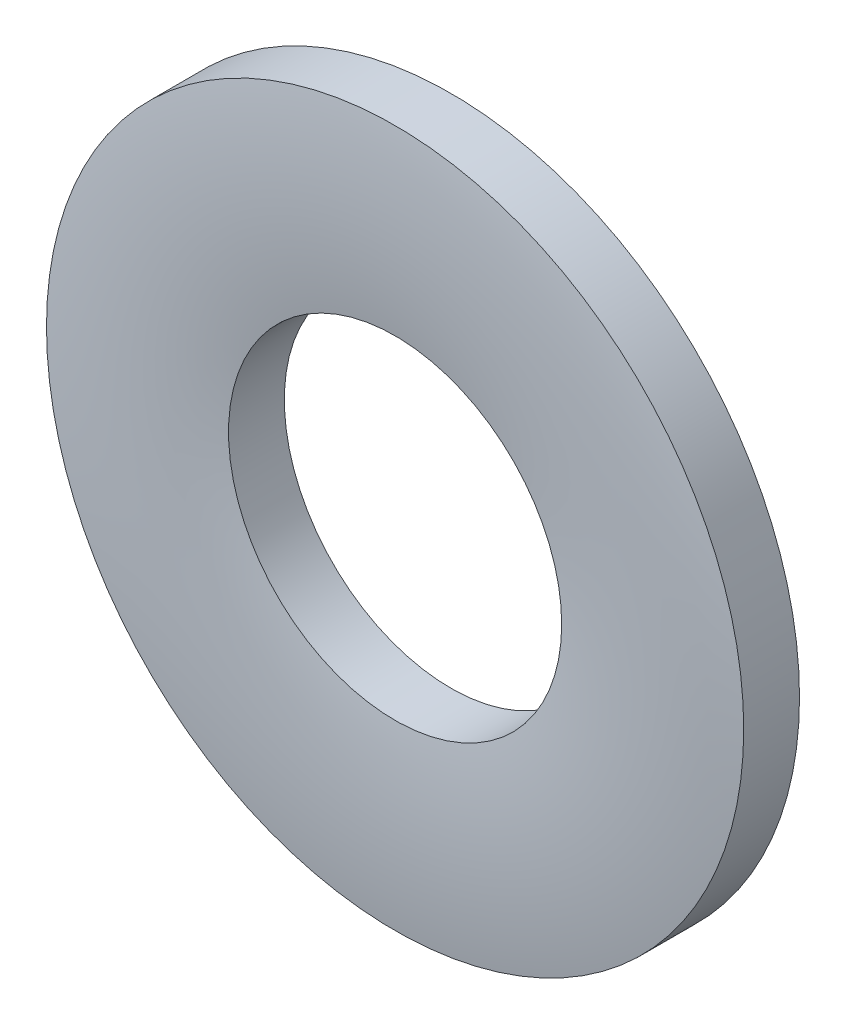
ISO-10303-21;
HEADER;
FILE_DESCRIPTION(('STEP AP214'),'2;1');
FILE_NAME('part.step','',(''),(''),'','','');
FILE_SCHEMA(('AUTOMOTIVE_DESIGN { 1 0 10303 214 1 1 1 1 }'));
ENDSEC;
DATA;
#1=APPLICATION_CONTEXT('core data for automotive mechanical design processes');
#2=APPLICATION_PROTOCOL_DEFINITION('international standard','automotive_design',2000,#1);
#3=PRODUCT_CONTEXT('',#1,'mechanical');
#4=PRODUCT('Part','Part','',(#3));
#5=PRODUCT_RELATED_PRODUCT_CATEGORY('part','',(#4));
#6=PRODUCT_DEFINITION_FORMATION('','',#4);
#7=PRODUCT_DEFINITION_CONTEXT('part definition',#1,'design');
#8=PRODUCT_DEFINITION('design','',#6,#7);
#9=PRODUCT_DEFINITION_SHAPE('','',#8);
#10=(LENGTH_UNIT() NAMED_UNIT(*) SI_UNIT(.MILLI.,.METRE.));
#11=(NAMED_UNIT(*) PLANE_ANGLE_UNIT() SI_UNIT($,.RADIAN.));
#12=(NAMED_UNIT(*) SI_UNIT($,.STERADIAN.) SOLID_ANGLE_UNIT());
#13=UNCERTAINTY_MEASURE_WITH_UNIT(LENGTH_MEASURE(1.E-05),#10,'distance_accuracy_value','');
#14=(GEOMETRIC_REPRESENTATION_CONTEXT(3) GLOBAL_UNCERTAINTY_ASSIGNED_CONTEXT((#13)) GLOBAL_UNIT_ASSIGNED_CONTEXT((#10,
#11,#12)) REPRESENTATION_CONTEXT('',''));
#15=CARTESIAN_POINT('',(0.,0.,0.));
#16=DIRECTION('',(0.,0.,1.));
#17=DIRECTION('',(1.,0.,0.));
#18=AXIS2_PLACEMENT_3D('',#15,#16,#17);
#19=CARTESIAN_POINT('',(0.,2.15,-0.400000000000003));
#20=DIRECTION('',(0.,0.,1.));
#21=DIRECTION('',(1.,0.,0.));
#22=AXIS2_PLACEMENT_3D('',#19,#20,#21);
#23=PLANE('',#22);
#24=CARTESIAN_POINT('',(0.,0.,-0.400000000000003));
#25=DIRECTION('',(0.,0.,1.));
#26=DIRECTION('',(1.,0.,0.));
#27=AXIS2_PLACEMENT_3D('',#24,#25,#26);
#28=CIRCLE('',#27,4.5);
#29=CARTESIAN_POINT('',(4.5,0.,-0.400000000000003));
#30=VERTEX_POINT('',#29);
#31=EDGE_CURVE('E51',#30,#30,#28,.T.);
#32=ORIENTED_EDGE('',*,*,#31,.F.);
#33=EDGE_LOOP('',(#32));
#34=FACE_BOUND('',#33,.T.);
#35=CARTESIAN_POINT('',(0.,0.,-0.400000000000003));
#36=DIRECTION('',(0.,0.,1.));
#37=DIRECTION('',(1.,0.,0.));
#38=AXIS2_PLACEMENT_3D('',#35,#36,#37);
#39=CIRCLE('',#38,2.15);
#40=CARTESIAN_POINT('',(2.15,0.,-0.400000000000003));
#41=VERTEX_POINT('',#40);
#42=EDGE_CURVE('E10',#41,#41,#39,.T.);
#43=ORIENTED_EDGE('',*,*,#42,.T.);
#44=EDGE_LOOP('',(#43));
#45=FACE_BOUND('',#44,.T.);
#46=ADVANCED_FACE('F37',(#34,#45),#23,.F.);
#47=CARTESIAN_POINT('',(0.,0.,0.4));
#48=DIRECTION('',(0.,0.,1.));
#49=DIRECTION('',(1.,0.,0.));
#50=AXIS2_PLACEMENT_3D('',#47,#48,#49);
#51=CYLINDRICAL_SURFACE('',#50,2.15);
#52=ORIENTED_EDGE('',*,*,#42,.F.);
#53=EDGE_LOOP('',(#52));
#54=FACE_BOUND('',#53,.T.);
#55=CARTESIAN_POINT('',(0.,0.,0.319999999999997));
#56=DIRECTION('',(0.,0.,1.));
#57=DIRECTION('',(1.,0.,0.));
#58=AXIS2_PLACEMENT_3D('',#55,#56,#57);
#59=CIRCLE('',#58,2.15);
#60=CARTESIAN_POINT('',(2.15,0.,0.319999999999997));
#61=VERTEX_POINT('',#60);
#62=EDGE_CURVE('E43',#61,#61,#59,.T.);
#63=ORIENTED_EDGE('',*,*,#62,.T.);
#64=EDGE_LOOP('',(#63));
#65=FACE_BOUND('',#64,.T.);
#66=ADVANCED_FACE('F60',(#54,#65),#51,.F.);
#67=CARTESIAN_POINT('',(0.,0.,-8.26890625000004));
#68=DIRECTION('',(0.,0.,1.));
#69=DIRECTION('',(1.,0.,0.));
#70=AXIS2_PLACEMENT_3D('',#67,#68,#69);
#71=DEGENERATE_TOROIDAL_SURFACE('',#70,3.325,8.66890625000004,.T.);
#72=ORIENTED_EDGE('',*,*,#62,.F.);
#73=EDGE_LOOP('',(#72));
#74=FACE_BOUND('',#73,.T.);
#75=CARTESIAN_POINT('',(0.,0.,0.319999999999997));
#76=DIRECTION('',(0.,0.,1.));
#77=DIRECTION('',(1.,0.,0.));
#78=AXIS2_PLACEMENT_3D('',#75,#76,#77);
#79=CIRCLE('',#78,4.5);
#80=CARTESIAN_POINT('',(4.5,0.,0.319999999999997));
#81=VERTEX_POINT('',#80);
#82=EDGE_CURVE('E47',#81,#81,#79,.T.);
#83=ORIENTED_EDGE('',*,*,#82,.T.);
#84=EDGE_LOOP('',(#83));
#85=FACE_BOUND('',#84,.T.);
#86=ADVANCED_FACE('F64',(#74,#85),#71,.T.);
#87=CARTESIAN_POINT('',(0.,0.,0.4));
#88=DIRECTION('',(0.,0.,1.));
#89=DIRECTION('',(1.,0.,0.));
#90=AXIS2_PLACEMENT_3D('',#87,#88,#89);
#91=CYLINDRICAL_SURFACE('',#90,4.5);
#92=ORIENTED_EDGE('',*,*,#82,.F.);
#93=EDGE_LOOP('',(#92));
#94=FACE_BOUND('',#93,.T.);
#95=ORIENTED_EDGE('',*,*,#31,.T.);
#96=EDGE_LOOP('',(#95));
#97=FACE_BOUND('',#96,.T.);
#98=ADVANCED_FACE('F57',(#94,#97),#91,.T.);
#99=CLOSED_SHELL('',(#46,#66,#86,#98));
#100=MANIFOLD_SOLID_BREP('B2',#99);
#101=ADVANCED_BREP_SHAPE_REPRESENTATION('',(#18,#100),#14);
#102=SHAPE_DEFINITION_REPRESENTATION(#9,#101);
ENDSEC;
END-ISO-10303-21;
